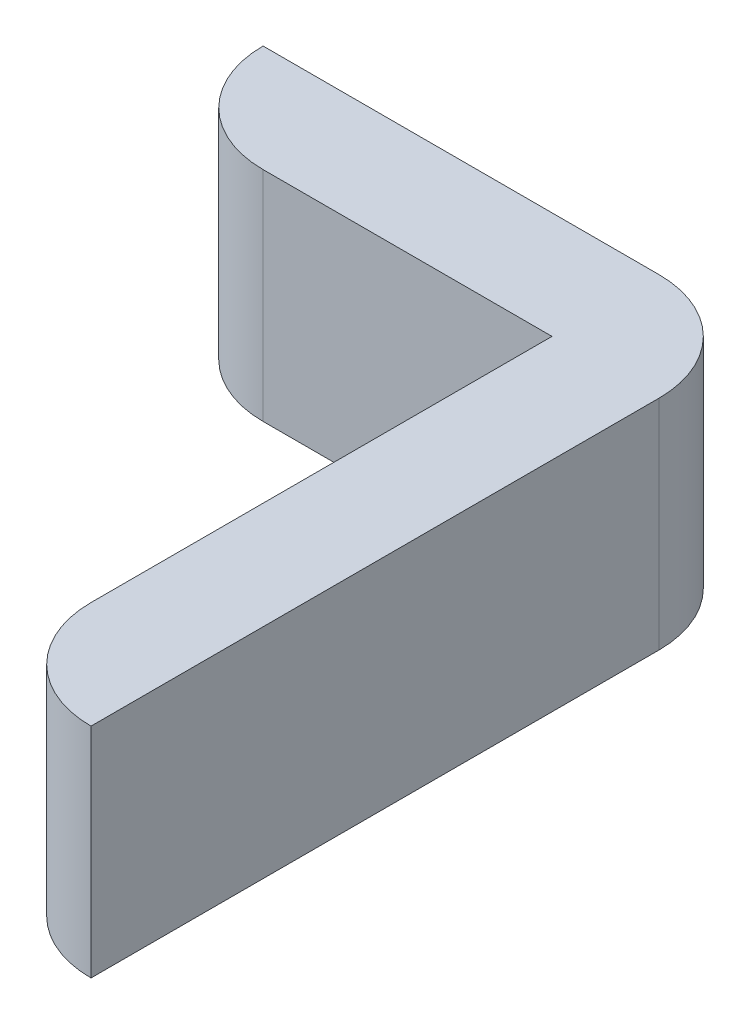
ISO-10303-21;
HEADER;
FILE_DESCRIPTION(('STEP AP214'),'2;1');
FILE_NAME('part.step','',(''),(''),'','','');
FILE_SCHEMA(('AUTOMOTIVE_DESIGN { 1 0 10303 214 1 1 1 1 }'));
ENDSEC;
DATA;
#1=APPLICATION_CONTEXT('core data for automotive mechanical design processes');
#2=APPLICATION_PROTOCOL_DEFINITION('international standard','automotive_design',2000,#1);
#3=PRODUCT_CONTEXT('',#1,'mechanical');
#4=PRODUCT('Part','Part','',(#3));
#5=PRODUCT_RELATED_PRODUCT_CATEGORY('part','',(#4));
#6=PRODUCT_DEFINITION_FORMATION('','',#4);
#7=PRODUCT_DEFINITION_CONTEXT('part definition',#1,'design');
#8=PRODUCT_DEFINITION('design','',#6,#7);
#9=PRODUCT_DEFINITION_SHAPE('','',#8);
#10=(LENGTH_UNIT() NAMED_UNIT(*) SI_UNIT(.MILLI.,.METRE.));
#11=(NAMED_UNIT(*) PLANE_ANGLE_UNIT() SI_UNIT($,.RADIAN.));
#12=(NAMED_UNIT(*) SI_UNIT($,.STERADIAN.) SOLID_ANGLE_UNIT());
#13=UNCERTAINTY_MEASURE_WITH_UNIT(LENGTH_MEASURE(1.E-05),#10,'distance_accuracy_value','');
#14=(GEOMETRIC_REPRESENTATION_CONTEXT(3) GLOBAL_UNCERTAINTY_ASSIGNED_CONTEXT((#13)) GLOBAL_UNIT_ASSIGNED_CONTEXT((#10,
#11,#12)) REPRESENTATION_CONTEXT('',''));
#15=CARTESIAN_POINT('',(0.,0.,0.));
#16=DIRECTION('',(0.,0.,1.));
#17=DIRECTION('',(1.,0.,0.));
#18=AXIS2_PLACEMENT_3D('',#15,#16,#17);
#19=CARTESIAN_POINT('',(9.275,0.2548,0.));
#20=DIRECTION('',(0.,-1.,0.));
#21=DIRECTION('',(0.,0.,-1.));
#22=AXIS2_PLACEMENT_3D('',#19,#20,#21);
#23=PLANE('',#22);
#24=DIRECTION('',(-1.,0.,0.));
#25=VECTOR('',#24,1.);
#26=CARTESIAN_POINT('',(9.525,0.2548,0.25));
#27=LINE('',#26,#25);
#28=CARTESIAN_POINT('',(9.525,0.2548,0.25));
#29=VERTEX_POINT('',#28);
#30=CARTESIAN_POINT('',(10.2,0.2548,0.25));
#31=VERTEX_POINT('',#30);
#32=EDGE_CURVE('E102',#29,#31,#27,.F.);
#33=ORIENTED_EDGE('',*,*,#32,.T.);
#34=DIRECTION('',(0.,0.,-1.));
#35=VECTOR('',#34,1.);
#36=CARTESIAN_POINT('',(10.2,0.2548,0.25));
#37=LINE('',#36,#35);
#38=CARTESIAN_POINT('',(10.2,0.2548,1.327));
#39=VERTEX_POINT('',#38);
#40=EDGE_CURVE('E108',#31,#39,#37,.F.);
#41=ORIENTED_EDGE('',*,*,#40,.T.);
#42=CARTESIAN_POINT('',(10.45,0.2548,1.327));
#43=DIRECTION('',(0.,-1.,0.));
#44=DIRECTION('',(0.,0.,-1.));
#45=AXIS2_PLACEMENT_3D('',#42,#43,#44);
#46=CIRCLE('',#45,0.25);
#47=CARTESIAN_POINT('',(10.45,0.2548,1.577));
#48=VERTEX_POINT('',#47);
#49=EDGE_CURVE('E80',#48,#39,#46,.T.);
#50=ORIENTED_EDGE('',*,*,#49,.F.);
#51=DIRECTION('',(0.,0.,1.));
#52=VECTOR('',#51,1.);
#53=CARTESIAN_POINT('',(10.45,0.2548,1.577));
#54=LINE('',#53,#52);
#55=CARTESIAN_POINT('',(10.45,0.2548,0.25));
#56=VERTEX_POINT('',#55);
#57=EDGE_CURVE('E75',#48,#56,#54,.F.);
#58=ORIENTED_EDGE('',*,*,#57,.T.);
#59=CARTESIAN_POINT('',(10.2,0.2548,0.25));
#60=DIRECTION('',(0.,-1.,0.));
#61=DIRECTION('',(0.,0.,-1.));
#62=AXIS2_PLACEMENT_3D('',#59,#60,#61);
#63=CIRCLE('',#62,0.25);
#64=CARTESIAN_POINT('',(10.2,0.2548,0.));
#65=VERTEX_POINT('',#64);
#66=EDGE_CURVE('E19',#65,#56,#63,.T.);
#67=ORIENTED_EDGE('',*,*,#66,.F.);
#68=DIRECTION('',(1.,0.,0.));
#69=VECTOR('',#68,1.);
#70=CARTESIAN_POINT('',(10.2,0.2548,0.));
#71=LINE('',#70,#69);
#72=CARTESIAN_POINT('',(9.275,0.2548,0.));
#73=VERTEX_POINT('',#72);
#74=EDGE_CURVE('E70',#65,#73,#71,.F.);
#75=ORIENTED_EDGE('',*,*,#74,.T.);
#76=CARTESIAN_POINT('',(9.525,0.2548,0.));
#77=DIRECTION('',(0.,-1.,0.));
#78=DIRECTION('',(0.,0.,-1.));
#79=AXIS2_PLACEMENT_3D('',#76,#77,#78);
#80=CIRCLE('',#79,0.25);
#81=EDGE_CURVE('E121',#29,#73,#80,.T.);
#82=ORIENTED_EDGE('',*,*,#81,.F.);
#83=EDGE_LOOP('',(#33,#41,#50,#58,#67,#75,#82));
#84=FACE_BOUND('',#83,.T.);
#85=ADVANCED_FACE('F16',(#84),#23,.F.);
#86=CARTESIAN_POINT('',(10.2,-0.2548,0.));
#87=DIRECTION('',(0.,0.,1.));
#88=DIRECTION('',(1.,0.,0.));
#89=AXIS2_PLACEMENT_3D('',#86,#87,#88);
#90=PLANE('',#89);
#91=DIRECTION('',(0.,-1.,0.));
#92=VECTOR('',#91,1.);
#93=CARTESIAN_POINT('',(9.275,-0.2548,0.));
#94=LINE('',#93,#92);
#95=CARTESIAN_POINT('',(9.275,-0.2548,0.));
#96=VERTEX_POINT('',#95);
#97=EDGE_CURVE('E123',#73,#96,#94,.T.);
#98=ORIENTED_EDGE('',*,*,#97,.F.);
#99=ORIENTED_EDGE('',*,*,#74,.F.);
#100=DIRECTION('',(0.,-1.,0.));
#101=VECTOR('',#100,1.);
#102=CARTESIAN_POINT('',(10.2,-0.2548,0.));
#103=LINE('',#102,#101);
#104=CARTESIAN_POINT('',(10.2,-0.2548,0.));
#105=VERTEX_POINT('',#104);
#106=EDGE_CURVE('E92',#105,#65,#103,.F.);
#107=ORIENTED_EDGE('',*,*,#106,.F.);
#108=DIRECTION('',(1.,0.,0.));
#109=VECTOR('',#108,1.);
#110=CARTESIAN_POINT('',(9.275,-0.2548,0.));
#111=LINE('',#110,#109);
#112=EDGE_CURVE('E120',#96,#105,#111,.T.);
#113=ORIENTED_EDGE('',*,*,#112,.F.);
#114=EDGE_LOOP('',(#98,#99,#107,#113));
#115=FACE_BOUND('',#114,.T.);
#116=ADVANCED_FACE('F158',(#115),#90,.F.);
#117=CARTESIAN_POINT('',(10.2,-0.2548,0.25));
#118=DIRECTION('',(0.,-1.,0.));
#119=DIRECTION('',(0.,0.,-1.));
#120=AXIS2_PLACEMENT_3D('',#117,#118,#119);
#121=CYLINDRICAL_SURFACE('',#120,0.25);
#122=ORIENTED_EDGE('',*,*,#66,.T.);
#123=DIRECTION('',(0.,1.,0.));
#124=VECTOR('',#123,1.);
#125=CARTESIAN_POINT('',(10.45,-0.2548,0.25));
#126=LINE('',#125,#124);
#127=CARTESIAN_POINT('',(10.45,-0.2548,0.25));
#128=VERTEX_POINT('',#127);
#129=EDGE_CURVE('E86',#56,#128,#126,.F.);
#130=ORIENTED_EDGE('',*,*,#129,.T.);
#131=CARTESIAN_POINT('',(10.2,-0.2548,0.25));
#132=DIRECTION('',(0.,-1.,0.));
#133=DIRECTION('',(0.,0.,-1.));
#134=AXIS2_PLACEMENT_3D('',#131,#132,#133);
#135=CIRCLE('',#134,0.25);
#136=EDGE_CURVE('E118',#105,#128,#135,.T.);
#137=ORIENTED_EDGE('',*,*,#136,.F.);
#138=ORIENTED_EDGE('',*,*,#106,.T.);
#139=EDGE_LOOP('',(#122,#130,#137,#138));
#140=FACE_BOUND('',#139,.T.);
#141=ADVANCED_FACE('F89',(#140),#121,.T.);
#142=CARTESIAN_POINT('',(10.45,-0.2548,1.577));
#143=DIRECTION('',(-1.,0.,0.));
#144=DIRECTION('',(0.,0.,1.));
#145=AXIS2_PLACEMENT_3D('',#142,#143,#144);
#146=PLANE('',#145);
#147=DIRECTION('',(0.,-1.,0.));
#148=VECTOR('',#147,1.);
#149=CARTESIAN_POINT('',(10.45,-0.2548,1.577));
#150=LINE('',#149,#148);
#151=CARTESIAN_POINT('',(10.45,-0.2548,1.577));
#152=VERTEX_POINT('',#151);
#153=EDGE_CURVE('E85',#152,#48,#150,.F.);
#154=ORIENTED_EDGE('',*,*,#153,.F.);
#155=DIRECTION('',(0.,0.,-1.));
#156=VECTOR('',#155,1.);
#157=CARTESIAN_POINT('',(10.45,-0.2548,0.));
#158=LINE('',#157,#156);
#159=EDGE_CURVE('E94',#128,#152,#158,.F.);
#160=ORIENTED_EDGE('',*,*,#159,.F.);
#161=ORIENTED_EDGE('',*,*,#129,.F.);
#162=ORIENTED_EDGE('',*,*,#57,.F.);
#163=EDGE_LOOP('',(#154,#160,#161,#162));
#164=FACE_BOUND('',#163,.T.);
#165=ADVANCED_FACE('F93',(#164),#146,.F.);
#166=CARTESIAN_POINT('',(10.45,-0.2548,1.327));
#167=DIRECTION('',(0.,-1.,0.));
#168=DIRECTION('',(0.,0.,-1.));
#169=AXIS2_PLACEMENT_3D('',#166,#167,#168);
#170=CYLINDRICAL_SURFACE('',#169,0.25);
#171=ORIENTED_EDGE('',*,*,#49,.T.);
#172=DIRECTION('',(0.,1.,0.));
#173=VECTOR('',#172,1.);
#174=CARTESIAN_POINT('',(10.2,-0.2548,1.327));
#175=LINE('',#174,#173);
#176=CARTESIAN_POINT('',(10.2,-0.2548,1.327));
#177=VERTEX_POINT('',#176);
#178=EDGE_CURVE('E105',#39,#177,#175,.F.);
#179=ORIENTED_EDGE('',*,*,#178,.T.);
#180=CARTESIAN_POINT('',(10.45,-0.2548,1.327));
#181=DIRECTION('',(0.,-1.,0.));
#182=DIRECTION('',(0.,0.,-1.));
#183=AXIS2_PLACEMENT_3D('',#180,#181,#182);
#184=CIRCLE('',#183,0.25);
#185=EDGE_CURVE('E114',#152,#177,#184,.T.);
#186=ORIENTED_EDGE('',*,*,#185,.F.);
#187=ORIENTED_EDGE('',*,*,#153,.T.);
#188=EDGE_LOOP('',(#171,#179,#186,#187));
#189=FACE_BOUND('',#188,.T.);
#190=ADVANCED_FACE('F127',(#189),#170,.T.);
#191=CARTESIAN_POINT('',(10.2,-0.2548,0.25));
#192=DIRECTION('',(1.,0.,0.));
#193=DIRECTION('',(0.,0.,-1.));
#194=AXIS2_PLACEMENT_3D('',#191,#192,#193);
#195=PLANE('',#194);
#196=ORIENTED_EDGE('',*,*,#178,.F.);
#197=ORIENTED_EDGE('',*,*,#40,.F.);
#198=DIRECTION('',(0.,1.,0.));
#199=VECTOR('',#198,1.);
#200=CARTESIAN_POINT('',(10.2,-0.2548,0.25));
#201=LINE('',#200,#199);
#202=CARTESIAN_POINT('',(10.2,-0.2548,0.25));
#203=VERTEX_POINT('',#202);
#204=EDGE_CURVE('E104',#31,#203,#201,.F.);
#205=ORIENTED_EDGE('',*,*,#204,.T.);
#206=DIRECTION('',(0.,0.,-1.));
#207=VECTOR('',#206,1.);
#208=CARTESIAN_POINT('',(10.2,-0.2548,0.));
#209=LINE('',#208,#207);
#210=EDGE_CURVE('E117',#177,#203,#209,.T.);
#211=ORIENTED_EDGE('',*,*,#210,.F.);
#212=EDGE_LOOP('',(#196,#197,#205,#211));
#213=FACE_BOUND('',#212,.T.);
#214=ADVANCED_FACE('F150',(#213),#195,.F.);
#215=CARTESIAN_POINT('',(9.525,-0.2548,0.25));
#216=DIRECTION('',(0.,0.,-1.));
#217=DIRECTION('',(-1.,0.,0.));
#218=AXIS2_PLACEMENT_3D('',#215,#216,#217);
#219=PLANE('',#218);
#220=ORIENTED_EDGE('',*,*,#204,.F.);
#221=ORIENTED_EDGE('',*,*,#32,.F.);
#222=DIRECTION('',(0.,-1.,0.));
#223=VECTOR('',#222,1.);
#224=CARTESIAN_POINT('',(9.525,-0.2548,0.25));
#225=LINE('',#224,#223);
#226=CARTESIAN_POINT('',(9.525,-0.2548,0.25));
#227=VERTEX_POINT('',#226);
#228=EDGE_CURVE('E34',#227,#29,#225,.F.);
#229=ORIENTED_EDGE('',*,*,#228,.F.);
#230=DIRECTION('',(1.,0.,0.));
#231=VECTOR('',#230,1.);
#232=CARTESIAN_POINT('',(9.275,-0.2548,0.25));
#233=LINE('',#232,#231);
#234=EDGE_CURVE('E25',#203,#227,#233,.F.);
#235=ORIENTED_EDGE('',*,*,#234,.F.);
#236=EDGE_LOOP('',(#220,#221,#229,#235));
#237=FACE_BOUND('',#236,.T.);
#238=ADVANCED_FACE('F151',(#237),#219,.F.);
#239=CARTESIAN_POINT('',(9.525,-0.2548,0.));
#240=DIRECTION('',(0.,-1.,0.));
#241=DIRECTION('',(0.,0.,-1.));
#242=AXIS2_PLACEMENT_3D('',#239,#240,#241);
#243=CYLINDRICAL_SURFACE('',#242,0.25);
#244=ORIENTED_EDGE('',*,*,#81,.T.);
#245=ORIENTED_EDGE('',*,*,#97,.T.);
#246=CARTESIAN_POINT('',(9.525,-0.2548,0.));
#247=DIRECTION('',(0.,-1.,0.));
#248=DIRECTION('',(0.,0.,-1.));
#249=AXIS2_PLACEMENT_3D('',#246,#247,#248);
#250=CIRCLE('',#249,0.25);
#251=EDGE_CURVE('E11',#227,#96,#250,.T.);
#252=ORIENTED_EDGE('',*,*,#251,.F.);
#253=ORIENTED_EDGE('',*,*,#228,.T.);
#254=EDGE_LOOP('',(#244,#245,#252,#253));
#255=FACE_BOUND('',#254,.T.);
#256=ADVANCED_FACE('F156',(#255),#243,.T.);
#257=CARTESIAN_POINT('',(9.275,-0.2548,0.));
#258=DIRECTION('',(0.,-1.,0.));
#259=DIRECTION('',(0.,0.,-1.));
#260=AXIS2_PLACEMENT_3D('',#257,#258,#259);
#261=PLANE('',#260);
#262=ORIENTED_EDGE('',*,*,#234,.T.);
#263=ORIENTED_EDGE('',*,*,#251,.T.);
#264=ORIENTED_EDGE('',*,*,#112,.T.);
#265=ORIENTED_EDGE('',*,*,#136,.T.);
#266=ORIENTED_EDGE('',*,*,#159,.T.);
#267=ORIENTED_EDGE('',*,*,#185,.T.);
#268=ORIENTED_EDGE('',*,*,#210,.T.);
#269=EDGE_LOOP('',(#262,#263,#264,#265,#266,#267,#268));
#270=FACE_BOUND('',#269,.T.);
#271=ADVANCED_FACE('F132',(#270),#261,.T.);
#272=CLOSED_SHELL('',(#85,#116,#141,#165,#190,#214,#238,#256,#271));
#273=MANIFOLD_SOLID_BREP('B1',#272);
#274=ADVANCED_BREP_SHAPE_REPRESENTATION('',(#18,#273),#14);
#275=SHAPE_DEFINITION_REPRESENTATION(#9,#274);
ENDSEC;
END-ISO-10303-21;
